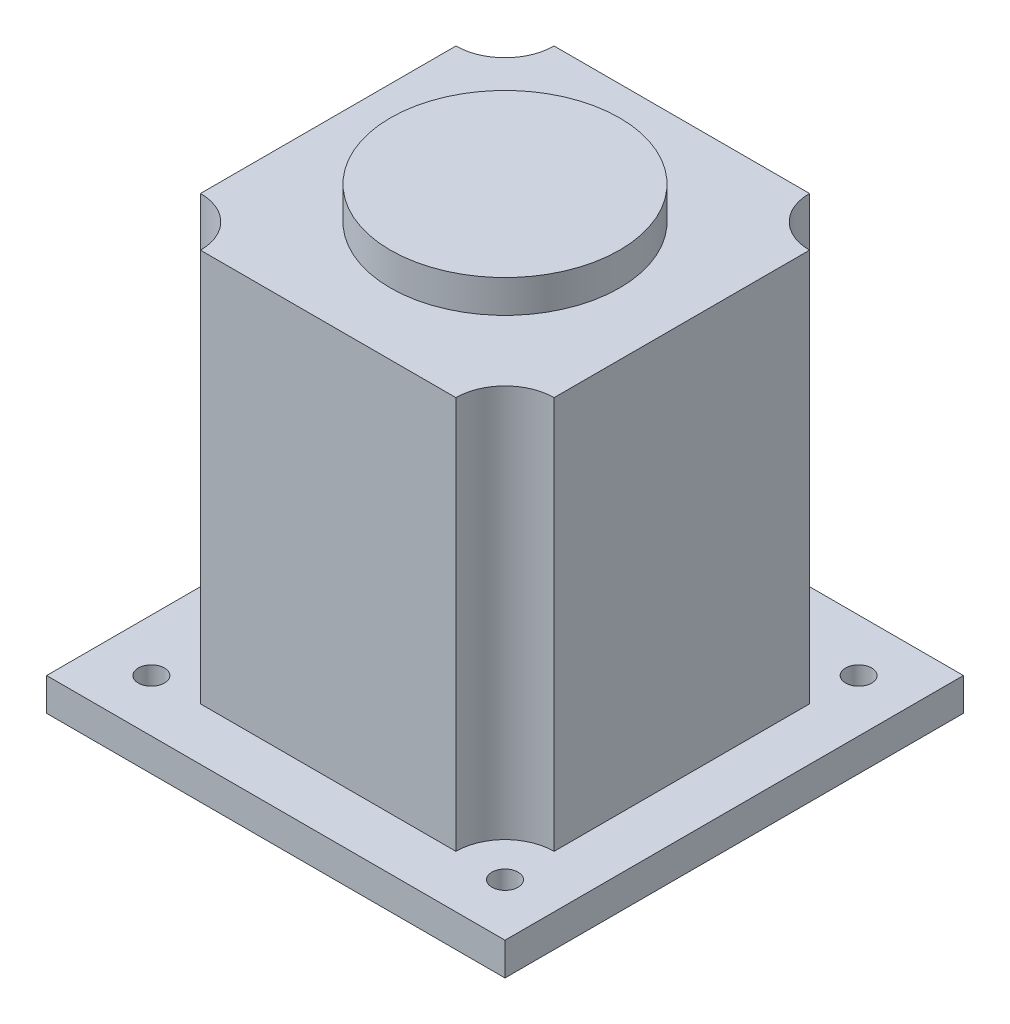
ISO-10303-21;
HEADER;
FILE_DESCRIPTION(('STEP AP214'),'2;1');
FILE_NAME('part.step','',(''),(''),'','','');
FILE_SCHEMA(('AUTOMOTIVE_DESIGN { 1 0 10303 214 1 1 1 1 }'));
ENDSEC;
DATA;
#1=APPLICATION_CONTEXT('core data for automotive mechanical design processes');
#2=APPLICATION_PROTOCOL_DEFINITION('international standard','automotive_design',2000,#1);
#3=PRODUCT_CONTEXT('',#1,'mechanical');
#4=PRODUCT('Part','Part','',(#3));
#5=PRODUCT_RELATED_PRODUCT_CATEGORY('part','',(#4));
#6=PRODUCT_DEFINITION_FORMATION('','',#4);
#7=PRODUCT_DEFINITION_CONTEXT('part definition',#1,'design');
#8=PRODUCT_DEFINITION('design','',#6,#7);
#9=PRODUCT_DEFINITION_SHAPE('','',#8);
#10=(LENGTH_UNIT() NAMED_UNIT(*) SI_UNIT(.MILLI.,.METRE.));
#11=(NAMED_UNIT(*) PLANE_ANGLE_UNIT() SI_UNIT($,.RADIAN.));
#12=(NAMED_UNIT(*) SI_UNIT($,.STERADIAN.) SOLID_ANGLE_UNIT());
#13=UNCERTAINTY_MEASURE_WITH_UNIT(LENGTH_MEASURE(1.E-05),#10,'distance_accuracy_value','');
#14=(GEOMETRIC_REPRESENTATION_CONTEXT(3) GLOBAL_UNCERTAINTY_ASSIGNED_CONTEXT((#13)) GLOBAL_UNIT_ASSIGNED_CONTEXT((#10,
#11,#12)) REPRESENTATION_CONTEXT('',''));
#15=CARTESIAN_POINT('',(0.,0.,0.));
#16=DIRECTION('',(0.,0.,1.));
#17=DIRECTION('',(1.,0.,0.));
#18=AXIS2_PLACEMENT_3D('',#15,#16,#17);
#19=CARTESIAN_POINT('',(0.,10.,0.));
#20=DIRECTION('',(0.,1.,0.));
#21=DIRECTION('',(0.,0.,1.));
#22=AXIS2_PLACEMENT_3D('',#19,#20,#21);
#23=PLANE('',#22);
#24=CARTESIAN_POINT('',(-54.,10.,54.));
#25=DIRECTION('',(0.,1.,0.));
#26=DIRECTION('',(0.,0.,1.));
#27=AXIS2_PLACEMENT_3D('',#24,#25,#26);
#28=CIRCLE('',#27,4.00000000000001);
#29=CARTESIAN_POINT('',(-54.,10.,58.));
#30=VERTEX_POINT('',#29);
#31=EDGE_CURVE('E169',#30,#30,#28,.T.);
#32=ORIENTED_EDGE('',*,*,#31,.F.);
#33=EDGE_LOOP('',(#32));
#34=FACE_BOUND('',#33,.T.);
#35=CARTESIAN_POINT('',(54.,10.,-54.));
#36=DIRECTION('',(0.,1.,0.));
#37=DIRECTION('',(0.,0.,1.));
#38=AXIS2_PLACEMENT_3D('',#35,#36,#37);
#39=CIRCLE('',#38,4.00000000000001);
#40=CARTESIAN_POINT('',(54.,10.,-50.));
#41=VERTEX_POINT('',#40);
#42=EDGE_CURVE('E181',#41,#41,#39,.T.);
#43=ORIENTED_EDGE('',*,*,#42,.F.);
#44=EDGE_LOOP('',(#43));
#45=FACE_BOUND('',#44,.T.);
#46=DIRECTION('',(0.,0.,1.));
#47=VECTOR('',#46,1.);
#48=CARTESIAN_POINT('',(-70.,10.,70.));
#49=LINE('',#48,#47);
#50=CARTESIAN_POINT('',(-70.,10.,-70.));
#51=VERTEX_POINT('',#50);
#52=CARTESIAN_POINT('',(-70.,10.,70.));
#53=VERTEX_POINT('',#52);
#54=EDGE_CURVE('E187',#51,#53,#49,.T.);
#55=ORIENTED_EDGE('',*,*,#54,.T.);
#56=DIRECTION('',(1.,0.,0.));
#57=VECTOR('',#56,1.);
#58=CARTESIAN_POINT('',(70.,10.,70.));
#59=LINE('',#58,#57);
#60=CARTESIAN_POINT('',(70.,10.,70.));
#61=VERTEX_POINT('',#60);
#62=EDGE_CURVE('E86',#53,#61,#59,.T.);
#63=ORIENTED_EDGE('',*,*,#62,.T.);
#64=DIRECTION('',(0.,0.,-1.));
#65=VECTOR('',#64,1.);
#66=CARTESIAN_POINT('',(70.,10.,70.));
#67=LINE('',#66,#65);
#68=CARTESIAN_POINT('',(70.,10.,-70.));
#69=VERTEX_POINT('',#68);
#70=EDGE_CURVE('E190',#61,#69,#67,.T.);
#71=ORIENTED_EDGE('',*,*,#70,.T.);
#72=DIRECTION('',(-1.,0.,0.));
#73=VECTOR('',#72,1.);
#74=CARTESIAN_POINT('',(70.,10.,-70.));
#75=LINE('',#74,#73);
#76=EDGE_CURVE('E57',#69,#51,#75,.T.);
#77=ORIENTED_EDGE('',*,*,#76,.T.);
#78=EDGE_LOOP('',(#55,#63,#71,#77));
#79=FACE_BOUND('',#78,.T.);
#80=CARTESIAN_POINT('',(54.,10.,54.));
#81=DIRECTION('',(0.,1.,0.));
#82=DIRECTION('',(0.,0.,1.));
#83=AXIS2_PLACEMENT_3D('',#80,#81,#82);
#84=CIRCLE('',#83,4.00000000000001);
#85=CARTESIAN_POINT('',(54.,10.,58.));
#86=VERTEX_POINT('',#85);
#87=EDGE_CURVE('E175',#86,#86,#84,.T.);
#88=ORIENTED_EDGE('',*,*,#87,.F.);
#89=EDGE_LOOP('',(#88));
#90=FACE_BOUND('',#89,.T.);
#91=CARTESIAN_POINT('',(-54.,10.,-54.));
#92=DIRECTION('',(0.,1.,0.));
#93=DIRECTION('',(0.,0.,1.));
#94=AXIS2_PLACEMENT_3D('',#91,#92,#93);
#95=CIRCLE('',#94,4.00000000000001);
#96=CARTESIAN_POINT('',(-54.,10.,-50.));
#97=VERTEX_POINT('',#96);
#98=EDGE_CURVE('E160',#97,#97,#95,.T.);
#99=ORIENTED_EDGE('',*,*,#98,.F.);
#100=EDGE_LOOP('',(#99));
#101=FACE_BOUND('',#100,.T.);
#102=DIRECTION('',(-1.,0.,0.));
#103=VECTOR('',#102,1.);
#104=CARTESIAN_POINT('',(39.,10.,-54.));
#105=LINE('',#104,#103);
#106=CARTESIAN_POINT('',(39.,10.,-54.));
#107=VERTEX_POINT('',#106);
#108=CARTESIAN_POINT('',(-39.,10.,-54.));
#109=VERTEX_POINT('',#108);
#110=EDGE_CURVE('E228',#107,#109,#105,.T.);
#111=ORIENTED_EDGE('',*,*,#110,.F.);
#112=CARTESIAN_POINT('',(54.,10.,-54.));
#113=DIRECTION('',(0.,-1.,0.));
#114=DIRECTION('',(0.,0.,1.));
#115=AXIS2_PLACEMENT_3D('',#112,#113,#114);
#116=CIRCLE('',#115,15.);
#117=CARTESIAN_POINT('',(54.,10.,-39.));
#118=VERTEX_POINT('',#117);
#119=EDGE_CURVE('E155',#118,#107,#116,.T.);
#120=ORIENTED_EDGE('',*,*,#119,.F.);
#121=DIRECTION('',(0.,0.,-1.));
#122=VECTOR('',#121,1.);
#123=CARTESIAN_POINT('',(54.,10.,-39.));
#124=LINE('',#123,#122);
#125=CARTESIAN_POINT('',(54.,10.,39.));
#126=VERTEX_POINT('',#125);
#127=EDGE_CURVE('E151',#126,#118,#124,.T.);
#128=ORIENTED_EDGE('',*,*,#127,.F.);
#129=CARTESIAN_POINT('',(54.,10.,54.));
#130=DIRECTION('',(0.,-1.,0.));
#131=DIRECTION('',(0.,0.,1.));
#132=AXIS2_PLACEMENT_3D('',#129,#130,#131);
#133=CIRCLE('',#132,15.);
#134=CARTESIAN_POINT('',(39.,10.,54.));
#135=VERTEX_POINT('',#134);
#136=EDGE_CURVE('E238',#135,#126,#133,.T.);
#137=ORIENTED_EDGE('',*,*,#136,.F.);
#138=DIRECTION('',(1.,0.,0.));
#139=VECTOR('',#138,1.);
#140=CARTESIAN_POINT('',(39.,10.,54.));
#141=LINE('',#140,#139);
#142=CARTESIAN_POINT('',(-39.,10.,54.));
#143=VERTEX_POINT('',#142);
#144=EDGE_CURVE('E236',#143,#135,#141,.T.);
#145=ORIENTED_EDGE('',*,*,#144,.F.);
#146=CARTESIAN_POINT('',(-54.,10.,54.));
#147=DIRECTION('',(0.,-1.,0.));
#148=DIRECTION('',(0.,0.,1.));
#149=AXIS2_PLACEMENT_3D('',#146,#147,#148);
#150=CIRCLE('',#149,15.);
#151=CARTESIAN_POINT('',(-54.,10.,39.));
#152=VERTEX_POINT('',#151);
#153=EDGE_CURVE('E234',#152,#143,#150,.T.);
#154=ORIENTED_EDGE('',*,*,#153,.F.);
#155=DIRECTION('',(0.,0.,1.));
#156=VECTOR('',#155,1.);
#157=CARTESIAN_POINT('',(-54.,10.,-39.));
#158=LINE('',#157,#156);
#159=CARTESIAN_POINT('',(-54.,10.,-39.));
#160=VERTEX_POINT('',#159);
#161=EDGE_CURVE('E232',#160,#152,#158,.T.);
#162=ORIENTED_EDGE('',*,*,#161,.F.);
#163=CARTESIAN_POINT('',(-54.,10.,-54.));
#164=DIRECTION('',(0.,-1.,0.));
#165=DIRECTION('',(0.,0.,1.));
#166=AXIS2_PLACEMENT_3D('',#163,#164,#165);
#167=CIRCLE('',#166,15.);
#168=EDGE_CURVE('E230',#109,#160,#167,.T.);
#169=ORIENTED_EDGE('',*,*,#168,.F.);
#170=EDGE_LOOP('',(#111,#120,#128,#137,#145,#154,#162,#169));
#171=FACE_BOUND('',#170,.T.);
#172=ADVANCED_FACE('F33',(#34,#45,#79,#90,#101,#171),#23,.T.);
#173=CARTESIAN_POINT('',(0.,0.,0.));
#174=DIRECTION('',(0.,1.,0.));
#175=DIRECTION('',(0.,0.,1.));
#176=AXIS2_PLACEMENT_3D('',#173,#174,#175);
#177=PLANE('',#176);
#178=CARTESIAN_POINT('',(0.,0.,0.));
#179=DIRECTION('',(0.,1.,0.));
#180=DIRECTION('',(0.,0.,1.));
#181=AXIS2_PLACEMENT_3D('',#178,#179,#180);
#182=CIRCLE('',#181,8.);
#183=CARTESIAN_POINT('',(0.,0.,8.));
#184=VERTEX_POINT('',#183);
#185=EDGE_CURVE('E11',#184,#184,#182,.F.);
#186=ORIENTED_EDGE('',*,*,#185,.F.);
#187=EDGE_LOOP('',(#186));
#188=FACE_BOUND('',#187,.T.);
#189=DIRECTION('',(0.,0.,1.));
#190=VECTOR('',#189,1.);
#191=CARTESIAN_POINT('',(-70.,0.,70.));
#192=LINE('',#191,#190);
#193=CARTESIAN_POINT('',(-70.,0.,-70.));
#194=VERTEX_POINT('',#193);
#195=CARTESIAN_POINT('',(-70.,0.,70.));
#196=VERTEX_POINT('',#195);
#197=EDGE_CURVE('E184',#194,#196,#192,.T.);
#198=ORIENTED_EDGE('',*,*,#197,.F.);
#199=DIRECTION('',(-1.,0.,0.));
#200=VECTOR('',#199,1.);
#201=CARTESIAN_POINT('',(70.,0.,-70.));
#202=LINE('',#201,#200);
#203=CARTESIAN_POINT('',(70.,0.,-70.));
#204=VERTEX_POINT('',#203);
#205=EDGE_CURVE('E78',#204,#194,#202,.T.);
#206=ORIENTED_EDGE('',*,*,#205,.F.);
#207=DIRECTION('',(0.,0.,-1.));
#208=VECTOR('',#207,1.);
#209=CARTESIAN_POINT('',(70.,0.,70.));
#210=LINE('',#209,#208);
#211=CARTESIAN_POINT('',(70.,0.,70.));
#212=VERTEX_POINT('',#211);
#213=EDGE_CURVE('E198',#212,#204,#210,.T.);
#214=ORIENTED_EDGE('',*,*,#213,.F.);
#215=DIRECTION('',(1.,0.,0.));
#216=VECTOR('',#215,1.);
#217=CARTESIAN_POINT('',(70.,0.,70.));
#218=LINE('',#217,#216);
#219=EDGE_CURVE('E196',#196,#212,#218,.T.);
#220=ORIENTED_EDGE('',*,*,#219,.F.);
#221=EDGE_LOOP('',(#198,#206,#214,#220));
#222=FACE_BOUND('',#221,.T.);
#223=CARTESIAN_POINT('',(54.,0.,-54.));
#224=DIRECTION('',(0.,1.,0.));
#225=DIRECTION('',(0.,0.,1.));
#226=AXIS2_PLACEMENT_3D('',#223,#224,#225);
#227=CIRCLE('',#226,4.00000000000001);
#228=CARTESIAN_POINT('',(54.,0.,-50.));
#229=VERTEX_POINT('',#228);
#230=EDGE_CURVE('E178',#229,#229,#227,.T.);
#231=ORIENTED_EDGE('',*,*,#230,.T.);
#232=EDGE_LOOP('',(#231));
#233=FACE_BOUND('',#232,.T.);
#234=CARTESIAN_POINT('',(54.,0.,54.));
#235=DIRECTION('',(0.,1.,0.));
#236=DIRECTION('',(0.,0.,1.));
#237=AXIS2_PLACEMENT_3D('',#234,#235,#236);
#238=CIRCLE('',#237,4.00000000000001);
#239=CARTESIAN_POINT('',(54.,0.,58.));
#240=VERTEX_POINT('',#239);
#241=EDGE_CURVE('E172',#240,#240,#238,.T.);
#242=ORIENTED_EDGE('',*,*,#241,.T.);
#243=EDGE_LOOP('',(#242));
#244=FACE_BOUND('',#243,.T.);
#245=CARTESIAN_POINT('',(-54.,0.,54.));
#246=DIRECTION('',(0.,1.,0.));
#247=DIRECTION('',(0.,0.,1.));
#248=AXIS2_PLACEMENT_3D('',#245,#246,#247);
#249=CIRCLE('',#248,4.00000000000001);
#250=CARTESIAN_POINT('',(-54.,0.,58.));
#251=VERTEX_POINT('',#250);
#252=EDGE_CURVE('E167',#251,#251,#249,.T.);
#253=ORIENTED_EDGE('',*,*,#252,.T.);
#254=EDGE_LOOP('',(#253));
#255=FACE_BOUND('',#254,.T.);
#256=CARTESIAN_POINT('',(-54.,0.,-54.));
#257=DIRECTION('',(0.,1.,0.));
#258=DIRECTION('',(0.,0.,1.));
#259=AXIS2_PLACEMENT_3D('',#256,#257,#258);
#260=CIRCLE('',#259,4.00000000000001);
#261=CARTESIAN_POINT('',(-54.,0.,-50.));
#262=VERTEX_POINT('',#261);
#263=EDGE_CURVE('E157',#262,#262,#260,.T.);
#264=ORIENTED_EDGE('',*,*,#263,.T.);
#265=EDGE_LOOP('',(#264));
#266=FACE_BOUND('',#265,.T.);
#267=ADVANCED_FACE('F283',(#188,#222,#233,#244,#255,#266),#177,.F.);
#268=CARTESIAN_POINT('',(-70.,10.,70.));
#269=DIRECTION('',(1.,0.,0.));
#270=DIRECTION('',(0.,0.,-1.));
#271=AXIS2_PLACEMENT_3D('',#268,#269,#270);
#272=PLANE('',#271);
#273=ORIENTED_EDGE('',*,*,#197,.T.);
#274=DIRECTION('',(0.,-1.,0.));
#275=VECTOR('',#274,1.);
#276=CARTESIAN_POINT('',(-70.,10.,70.));
#277=LINE('',#276,#275);
#278=EDGE_CURVE('E206',#53,#196,#277,.T.);
#279=ORIENTED_EDGE('',*,*,#278,.F.);
#280=ORIENTED_EDGE('',*,*,#54,.F.);
#281=DIRECTION('',(0.,-1.,0.));
#282=VECTOR('',#281,1.);
#283=CARTESIAN_POINT('',(-70.,10.,-70.));
#284=LINE('',#283,#282);
#285=EDGE_CURVE('E193',#51,#194,#284,.T.);
#286=ORIENTED_EDGE('',*,*,#285,.T.);
#287=EDGE_LOOP('',(#273,#279,#280,#286));
#288=FACE_BOUND('',#287,.T.);
#289=ADVANCED_FACE('F35',(#288),#272,.F.);
#290=CARTESIAN_POINT('',(70.,10.,70.));
#291=DIRECTION('',(0.,0.,-1.));
#292=DIRECTION('',(-1.,0.,0.));
#293=AXIS2_PLACEMENT_3D('',#290,#291,#292);
#294=PLANE('',#293);
#295=ORIENTED_EDGE('',*,*,#219,.T.);
#296=DIRECTION('',(0.,-1.,0.));
#297=VECTOR('',#296,1.);
#298=CARTESIAN_POINT('',(70.,10.,70.));
#299=LINE('',#298,#297);
#300=EDGE_CURVE('E204',#61,#212,#299,.T.);
#301=ORIENTED_EDGE('',*,*,#300,.F.);
#302=ORIENTED_EDGE('',*,*,#62,.F.);
#303=ORIENTED_EDGE('',*,*,#278,.T.);
#304=EDGE_LOOP('',(#295,#301,#302,#303));
#305=FACE_BOUND('',#304,.T.);
#306=ADVANCED_FACE('F302',(#305),#294,.F.);
#307=CARTESIAN_POINT('',(70.,10.,70.));
#308=DIRECTION('',(-1.,0.,0.));
#309=DIRECTION('',(0.,0.,1.));
#310=AXIS2_PLACEMENT_3D('',#307,#308,#309);
#311=PLANE('',#310);
#312=ORIENTED_EDGE('',*,*,#213,.T.);
#313=DIRECTION('',(0.,-1.,0.));
#314=VECTOR('',#313,1.);
#315=CARTESIAN_POINT('',(70.,10.,-70.));
#316=LINE('',#315,#314);
#317=EDGE_CURVE('E202',#69,#204,#316,.T.);
#318=ORIENTED_EDGE('',*,*,#317,.F.);
#319=ORIENTED_EDGE('',*,*,#70,.F.);
#320=ORIENTED_EDGE('',*,*,#300,.T.);
#321=EDGE_LOOP('',(#312,#318,#319,#320));
#322=FACE_BOUND('',#321,.T.);
#323=ADVANCED_FACE('F300',(#322),#311,.F.);
#324=CARTESIAN_POINT('',(70.,10.,-70.));
#325=DIRECTION('',(0.,0.,1.));
#326=DIRECTION('',(1.,0.,0.));
#327=AXIS2_PLACEMENT_3D('',#324,#325,#326);
#328=PLANE('',#327);
#329=ORIENTED_EDGE('',*,*,#205,.T.);
#330=ORIENTED_EDGE('',*,*,#285,.F.);
#331=ORIENTED_EDGE('',*,*,#76,.F.);
#332=ORIENTED_EDGE('',*,*,#317,.T.);
#333=EDGE_LOOP('',(#329,#330,#331,#332));
#334=FACE_BOUND('',#333,.T.);
#335=ADVANCED_FACE('F297',(#334),#328,.F.);
#336=CARTESIAN_POINT('',(54.,10.,-54.));
#337=DIRECTION('',(0.,-1.,0.));
#338=DIRECTION('',(0.,0.,-1.));
#339=AXIS2_PLACEMENT_3D('',#336,#337,#338);
#340=CYLINDRICAL_SURFACE('',#339,4.00000000000001);
#341=ORIENTED_EDGE('',*,*,#42,.T.);
#342=EDGE_LOOP('',(#341));
#343=FACE_BOUND('',#342,.T.);
#344=ORIENTED_EDGE('',*,*,#230,.F.);
#345=EDGE_LOOP('',(#344));
#346=FACE_BOUND('',#345,.T.);
#347=ADVANCED_FACE('F294',(#343,#346),#340,.F.);
#348=CARTESIAN_POINT('',(54.,10.,54.));
#349=DIRECTION('',(0.,-1.,0.));
#350=DIRECTION('',(0.,0.,-1.));
#351=AXIS2_PLACEMENT_3D('',#348,#349,#350);
#352=CYLINDRICAL_SURFACE('',#351,4.00000000000001);
#353=ORIENTED_EDGE('',*,*,#87,.T.);
#354=EDGE_LOOP('',(#353));
#355=FACE_BOUND('',#354,.T.);
#356=ORIENTED_EDGE('',*,*,#241,.F.);
#357=EDGE_LOOP('',(#356));
#358=FACE_BOUND('',#357,.T.);
#359=ADVANCED_FACE('F333',(#355,#358),#352,.F.);
#360=CARTESIAN_POINT('',(-54.,10.,54.));
#361=DIRECTION('',(0.,-1.,0.));
#362=DIRECTION('',(0.,0.,-1.));
#363=AXIS2_PLACEMENT_3D('',#360,#361,#362);
#364=CYLINDRICAL_SURFACE('',#363,4.00000000000001);
#365=ORIENTED_EDGE('',*,*,#31,.T.);
#366=EDGE_LOOP('',(#365));
#367=FACE_BOUND('',#366,.T.);
#368=ORIENTED_EDGE('',*,*,#252,.F.);
#369=EDGE_LOOP('',(#368));
#370=FACE_BOUND('',#369,.T.);
#371=ADVANCED_FACE('F324',(#367,#370),#364,.F.);
#372=CARTESIAN_POINT('',(-54.,10.,-54.));
#373=DIRECTION('',(0.,-1.,0.));
#374=DIRECTION('',(0.,0.,-1.));
#375=AXIS2_PLACEMENT_3D('',#372,#373,#374);
#376=CYLINDRICAL_SURFACE('',#375,4.00000000000001);
#377=ORIENTED_EDGE('',*,*,#98,.T.);
#378=EDGE_LOOP('',(#377));
#379=FACE_BOUND('',#378,.T.);
#380=ORIENTED_EDGE('',*,*,#263,.F.);
#381=EDGE_LOOP('',(#380));
#382=FACE_BOUND('',#381,.T.);
#383=ADVANCED_FACE('F321',(#379,#382),#376,.F.);
#384=CARTESIAN_POINT('',(54.,130.,-54.));
#385=DIRECTION('',(0.,-1.,0.));
#386=DIRECTION('',(0.,0.,-1.));
#387=AXIS2_PLACEMENT_3D('',#384,#385,#386);
#388=CYLINDRICAL_SURFACE('',#387,15.);
#389=ORIENTED_EDGE('',*,*,#119,.T.);
#390=DIRECTION('',(0.,-1.,0.));
#391=VECTOR('',#390,1.);
#392=CARTESIAN_POINT('',(39.,130.,-54.));
#393=LINE('',#392,#391);
#394=CARTESIAN_POINT('',(39.,130.,-54.));
#395=VERTEX_POINT('',#394);
#396=EDGE_CURVE('E136',#395,#107,#393,.T.);
#397=ORIENTED_EDGE('',*,*,#396,.F.);
#398=CARTESIAN_POINT('',(54.,130.,-54.));
#399=DIRECTION('',(0.,-1.,0.));
#400=DIRECTION('',(0.,0.,1.));
#401=AXIS2_PLACEMENT_3D('',#398,#399,#400);
#402=CIRCLE('',#401,15.);
#403=CARTESIAN_POINT('',(54.,130.,-39.));
#404=VERTEX_POINT('',#403);
#405=EDGE_CURVE('E143',#404,#395,#402,.T.);
#406=ORIENTED_EDGE('',*,*,#405,.F.);
#407=DIRECTION('',(0.,-1.,0.));
#408=VECTOR('',#407,1.);
#409=CARTESIAN_POINT('',(54.,130.,-39.));
#410=LINE('',#409,#408);
#411=EDGE_CURVE('E226',#404,#118,#410,.T.);
#412=ORIENTED_EDGE('',*,*,#411,.T.);
#413=EDGE_LOOP('',(#389,#397,#406,#412));
#414=FACE_BOUND('',#413,.T.);
#415=ADVANCED_FACE('F153',(#414),#388,.F.);
#416=CARTESIAN_POINT('',(39.,130.,-54.));
#417=DIRECTION('',(0.,0.,1.));
#418=DIRECTION('',(1.,0.,0.));
#419=AXIS2_PLACEMENT_3D('',#416,#417,#418);
#420=PLANE('',#419);
#421=ORIENTED_EDGE('',*,*,#110,.T.);
#422=DIRECTION('',(0.,-1.,0.));
#423=VECTOR('',#422,1.);
#424=CARTESIAN_POINT('',(-39.,130.,-54.));
#425=LINE('',#424,#423);
#426=CARTESIAN_POINT('',(-39.,130.,-54.));
#427=VERTEX_POINT('',#426);
#428=EDGE_CURVE('E139',#427,#109,#425,.T.);
#429=ORIENTED_EDGE('',*,*,#428,.F.);
#430=DIRECTION('',(-1.,0.,0.));
#431=VECTOR('',#430,1.);
#432=CARTESIAN_POINT('',(39.,130.,-54.));
#433=LINE('',#432,#431);
#434=EDGE_CURVE('E132',#395,#427,#433,.T.);
#435=ORIENTED_EDGE('',*,*,#434,.F.);
#436=ORIENTED_EDGE('',*,*,#396,.T.);
#437=EDGE_LOOP('',(#421,#429,#435,#436));
#438=FACE_BOUND('',#437,.T.);
#439=ADVANCED_FACE('F134',(#438),#420,.F.);
#440=CARTESIAN_POINT('',(-54.,130.,-54.));
#441=DIRECTION('',(0.,-1.,0.));
#442=DIRECTION('',(0.,0.,-1.));
#443=AXIS2_PLACEMENT_3D('',#440,#441,#442);
#444=CYLINDRICAL_SURFACE('',#443,15.);
#445=ORIENTED_EDGE('',*,*,#168,.T.);
#446=DIRECTION('',(0.,-1.,0.));
#447=VECTOR('',#446,1.);
#448=CARTESIAN_POINT('',(-54.,130.,-39.));
#449=LINE('',#448,#447);
#450=CARTESIAN_POINT('',(-54.,130.,-39.));
#451=VERTEX_POINT('',#450);
#452=EDGE_CURVE('E162',#451,#160,#449,.T.);
#453=ORIENTED_EDGE('',*,*,#452,.F.);
#454=CARTESIAN_POINT('',(-54.,130.,-54.));
#455=DIRECTION('',(0.,-1.,0.));
#456=DIRECTION('',(0.,0.,1.));
#457=AXIS2_PLACEMENT_3D('',#454,#455,#456);
#458=CIRCLE('',#457,15.);
#459=EDGE_CURVE('E142',#427,#451,#458,.T.);
#460=ORIENTED_EDGE('',*,*,#459,.F.);
#461=ORIENTED_EDGE('',*,*,#428,.T.);
#462=EDGE_LOOP('',(#445,#453,#460,#461));
#463=FACE_BOUND('',#462,.T.);
#464=ADVANCED_FACE('F273',(#463),#444,.F.);
#465=CARTESIAN_POINT('',(-54.,130.,-39.));
#466=DIRECTION('',(1.,0.,0.));
#467=DIRECTION('',(0.,0.,-1.));
#468=AXIS2_PLACEMENT_3D('',#465,#466,#467);
#469=PLANE('',#468);
#470=ORIENTED_EDGE('',*,*,#161,.T.);
#471=DIRECTION('',(0.,-1.,0.));
#472=VECTOR('',#471,1.);
#473=CARTESIAN_POINT('',(-54.,130.,39.));
#474=LINE('',#473,#472);
#475=CARTESIAN_POINT('',(-54.,130.,39.));
#476=VERTEX_POINT('',#475);
#477=EDGE_CURVE('E249',#476,#152,#474,.T.);
#478=ORIENTED_EDGE('',*,*,#477,.F.);
#479=DIRECTION('',(0.,0.,1.));
#480=VECTOR('',#479,1.);
#481=CARTESIAN_POINT('',(-54.,130.,-39.));
#482=LINE('',#481,#480);
#483=EDGE_CURVE('E217',#451,#476,#482,.T.);
#484=ORIENTED_EDGE('',*,*,#483,.F.);
#485=ORIENTED_EDGE('',*,*,#452,.T.);
#486=EDGE_LOOP('',(#470,#478,#484,#485));
#487=FACE_BOUND('',#486,.T.);
#488=ADVANCED_FACE('F256',(#487),#469,.F.);
#489=CARTESIAN_POINT('',(-54.,130.,54.));
#490=DIRECTION('',(0.,-1.,0.));
#491=DIRECTION('',(0.,0.,-1.));
#492=AXIS2_PLACEMENT_3D('',#489,#490,#491);
#493=CYLINDRICAL_SURFACE('',#492,15.);
#494=ORIENTED_EDGE('',*,*,#153,.T.);
#495=DIRECTION('',(0.,-1.,0.));
#496=VECTOR('',#495,1.);
#497=CARTESIAN_POINT('',(-39.,130.,54.));
#498=LINE('',#497,#496);
#499=CARTESIAN_POINT('',(-39.,130.,54.));
#500=VERTEX_POINT('',#499);
#501=EDGE_CURVE('E246',#500,#143,#498,.T.);
#502=ORIENTED_EDGE('',*,*,#501,.F.);
#503=CARTESIAN_POINT('',(-54.,130.,54.));
#504=DIRECTION('',(0.,-1.,0.));
#505=DIRECTION('',(0.,0.,1.));
#506=AXIS2_PLACEMENT_3D('',#503,#504,#505);
#507=CIRCLE('',#506,15.);
#508=EDGE_CURVE('E219',#476,#500,#507,.T.);
#509=ORIENTED_EDGE('',*,*,#508,.F.);
#510=ORIENTED_EDGE('',*,*,#477,.T.);
#511=EDGE_LOOP('',(#494,#502,#509,#510));
#512=FACE_BOUND('',#511,.T.);
#513=ADVANCED_FACE('F266',(#512),#493,.F.);
#514=CARTESIAN_POINT('',(39.,130.,54.));
#515=DIRECTION('',(0.,0.,-1.));
#516=DIRECTION('',(-1.,0.,0.));
#517=AXIS2_PLACEMENT_3D('',#514,#515,#516);
#518=PLANE('',#517);
#519=ORIENTED_EDGE('',*,*,#144,.T.);
#520=DIRECTION('',(0.,-1.,0.));
#521=VECTOR('',#520,1.);
#522=CARTESIAN_POINT('',(39.,130.,54.));
#523=LINE('',#522,#521);
#524=CARTESIAN_POINT('',(39.,130.,54.));
#525=VERTEX_POINT('',#524);
#526=EDGE_CURVE('E243',#525,#135,#523,.T.);
#527=ORIENTED_EDGE('',*,*,#526,.F.);
#528=DIRECTION('',(1.,0.,0.));
#529=VECTOR('',#528,1.);
#530=CARTESIAN_POINT('',(39.,130.,54.));
#531=LINE('',#530,#529);
#532=EDGE_CURVE('E221',#500,#525,#531,.T.);
#533=ORIENTED_EDGE('',*,*,#532,.F.);
#534=ORIENTED_EDGE('',*,*,#501,.T.);
#535=EDGE_LOOP('',(#519,#527,#533,#534));
#536=FACE_BOUND('',#535,.T.);
#537=ADVANCED_FACE('F270',(#536),#518,.F.);
#538=CARTESIAN_POINT('',(54.,130.,54.));
#539=DIRECTION('',(0.,-1.,0.));
#540=DIRECTION('',(0.,0.,-1.));
#541=AXIS2_PLACEMENT_3D('',#538,#539,#540);
#542=CYLINDRICAL_SURFACE('',#541,15.);
#543=ORIENTED_EDGE('',*,*,#136,.T.);
#544=DIRECTION('',(0.,-1.,0.));
#545=VECTOR('',#544,1.);
#546=CARTESIAN_POINT('',(54.,130.,39.));
#547=LINE('',#546,#545);
#548=CARTESIAN_POINT('',(54.,130.,39.));
#549=VERTEX_POINT('',#548);
#550=EDGE_CURVE('E48',#549,#126,#547,.T.);
#551=ORIENTED_EDGE('',*,*,#550,.F.);
#552=CARTESIAN_POINT('',(54.,130.,54.));
#553=DIRECTION('',(0.,-1.,0.));
#554=DIRECTION('',(0.,0.,1.));
#555=AXIS2_PLACEMENT_3D('',#552,#553,#554);
#556=CIRCLE('',#555,15.);
#557=EDGE_CURVE('E223',#525,#549,#556,.T.);
#558=ORIENTED_EDGE('',*,*,#557,.F.);
#559=ORIENTED_EDGE('',*,*,#526,.T.);
#560=EDGE_LOOP('',(#543,#551,#558,#559));
#561=FACE_BOUND('',#560,.T.);
#562=ADVANCED_FACE('F421',(#561),#542,.F.);
#563=CARTESIAN_POINT('',(54.,130.,-39.));
#564=DIRECTION('',(-1.,0.,0.));
#565=DIRECTION('',(0.,0.,1.));
#566=AXIS2_PLACEMENT_3D('',#563,#564,#565);
#567=PLANE('',#566);
#568=ORIENTED_EDGE('',*,*,#127,.T.);
#569=ORIENTED_EDGE('',*,*,#411,.F.);
#570=DIRECTION('',(0.,0.,-1.));
#571=VECTOR('',#570,1.);
#572=CARTESIAN_POINT('',(54.,130.,-39.));
#573=LINE('',#572,#571);
#574=EDGE_CURVE('E147',#549,#404,#573,.T.);
#575=ORIENTED_EDGE('',*,*,#574,.F.);
#576=ORIENTED_EDGE('',*,*,#550,.T.);
#577=EDGE_LOOP('',(#568,#569,#575,#576));
#578=FACE_BOUND('',#577,.T.);
#579=ADVANCED_FACE('F417',(#578),#567,.F.);
#580=CARTESIAN_POINT('',(54.,130.,-54.));
#581=DIRECTION('',(0.,1.,0.));
#582=DIRECTION('',(0.,0.,1.));
#583=AXIS2_PLACEMENT_3D('',#580,#581,#582);
#584=PLANE('',#583);
#585=CARTESIAN_POINT('',(0.,130.,0.));
#586=DIRECTION('',(0.,1.,0.));
#587=DIRECTION('',(0.,0.,1.));
#588=AXIS2_PLACEMENT_3D('',#585,#586,#587);
#589=CIRCLE('',#588,35.);
#590=CARTESIAN_POINT('',(0.,130.,35.));
#591=VERTEX_POINT('',#590);
#592=EDGE_CURVE('E41',#591,#591,#589,.T.);
#593=ORIENTED_EDGE('',*,*,#592,.F.);
#594=EDGE_LOOP('',(#593));
#595=FACE_BOUND('',#594,.T.);
#596=ORIENTED_EDGE('',*,*,#405,.T.);
#597=ORIENTED_EDGE('',*,*,#434,.T.);
#598=ORIENTED_EDGE('',*,*,#459,.T.);
#599=ORIENTED_EDGE('',*,*,#483,.T.);
#600=ORIENTED_EDGE('',*,*,#508,.T.);
#601=ORIENTED_EDGE('',*,*,#532,.T.);
#602=ORIENTED_EDGE('',*,*,#557,.T.);
#603=ORIENTED_EDGE('',*,*,#574,.T.);
#604=EDGE_LOOP('',(#596,#597,#598,#599,#600,#601,#602,#603));
#605=FACE_BOUND('',#604,.T.);
#606=ADVANCED_FACE('F146',(#595,#605),#584,.T.);
#607=CARTESIAN_POINT('',(0.,140.,0.));
#608=DIRECTION('',(0.,-1.,0.));
#609=DIRECTION('',(0.,0.,-1.));
#610=AXIS2_PLACEMENT_3D('',#607,#608,#609);
#611=CYLINDRICAL_SURFACE('',#610,35.);
#612=CARTESIAN_POINT('',(0.,140.,0.));
#613=DIRECTION('',(0.,1.,0.));
#614=DIRECTION('',(0.,0.,1.));
#615=AXIS2_PLACEMENT_3D('',#612,#613,#614);
#616=CIRCLE('',#615,35.);
#617=CARTESIAN_POINT('',(0.,140.,35.));
#618=VERTEX_POINT('',#617);
#619=EDGE_CURVE('E213',#618,#618,#616,.T.);
#620=ORIENTED_EDGE('',*,*,#619,.F.);
#621=EDGE_LOOP('',(#620));
#622=FACE_BOUND('',#621,.T.);
#623=ORIENTED_EDGE('',*,*,#592,.T.);
#624=EDGE_LOOP('',(#623));
#625=FACE_BOUND('',#624,.T.);
#626=ADVANCED_FACE('F410',(#622,#625),#611,.T.);
#627=CARTESIAN_POINT('',(0.,140.,0.));
#628=DIRECTION('',(0.,1.,0.));
#629=DIRECTION('',(0.,0.,1.));
#630=AXIS2_PLACEMENT_3D('',#627,#628,#629);
#631=PLANE('',#630);
#632=ORIENTED_EDGE('',*,*,#619,.T.);
#633=EDGE_LOOP('',(#632));
#634=FACE_BOUND('',#633,.T.);
#635=ADVANCED_FACE('F383',(#634),#631,.T.);
#636=CARTESIAN_POINT('',(0.,-5.,0.));
#637=DIRECTION('',(0.,1.,0.));
#638=DIRECTION('',(0.,0.,1.));
#639=AXIS2_PLACEMENT_3D('',#636,#637,#638);
#640=CYLINDRICAL_SURFACE('',#639,8.);
#641=CARTESIAN_POINT('',(0.,-5.,0.));
#642=DIRECTION('',(0.,-1.,0.));
#643=DIRECTION('',(0.,0.,-1.));
#644=AXIS2_PLACEMENT_3D('',#641,#642,#643);
#645=CIRCLE('',#644,8.);
#646=CARTESIAN_POINT('',(0.,-5.,-8.));
#647=VERTEX_POINT('',#646);
#648=EDGE_CURVE('E513',#647,#647,#645,.T.);
#649=ORIENTED_EDGE('',*,*,#648,.F.);
#650=EDGE_LOOP('',(#649));
#651=FACE_BOUND('',#650,.T.);
#652=ORIENTED_EDGE('',*,*,#185,.T.);
#653=EDGE_LOOP('',(#652));
#654=FACE_BOUND('',#653,.T.);
#655=ADVANCED_FACE('F388',(#651,#654),#640,.T.);
#656=CARTESIAN_POINT('',(0.,-5.,0.));
#657=DIRECTION('',(0.,-1.,0.));
#658=DIRECTION('',(0.,0.,-1.));
#659=AXIS2_PLACEMENT_3D('',#656,#657,#658);
#660=PLANE('',#659);
#661=ORIENTED_EDGE('',*,*,#648,.T.);
#662=EDGE_LOOP('',(#661));
#663=FACE_BOUND('',#662,.T.);
#664=ADVANCED_FACE('F393',(#663),#660,.T.);
#665=CLOSED_SHELL('',(#172,#267,#289,#306,#323,#335,#347,#359,#371,#383,#415,#439,#464,#488,
#513,#537,#562,#579,#606,#626,#635,#655,#664));
#666=MANIFOLD_SOLID_BREP('B2',#665);
#667=ADVANCED_BREP_SHAPE_REPRESENTATION('',(#18,#666),#14);
#668=SHAPE_DEFINITION_REPRESENTATION(#9,#667);
ENDSEC;
END-ISO-10303-21;
